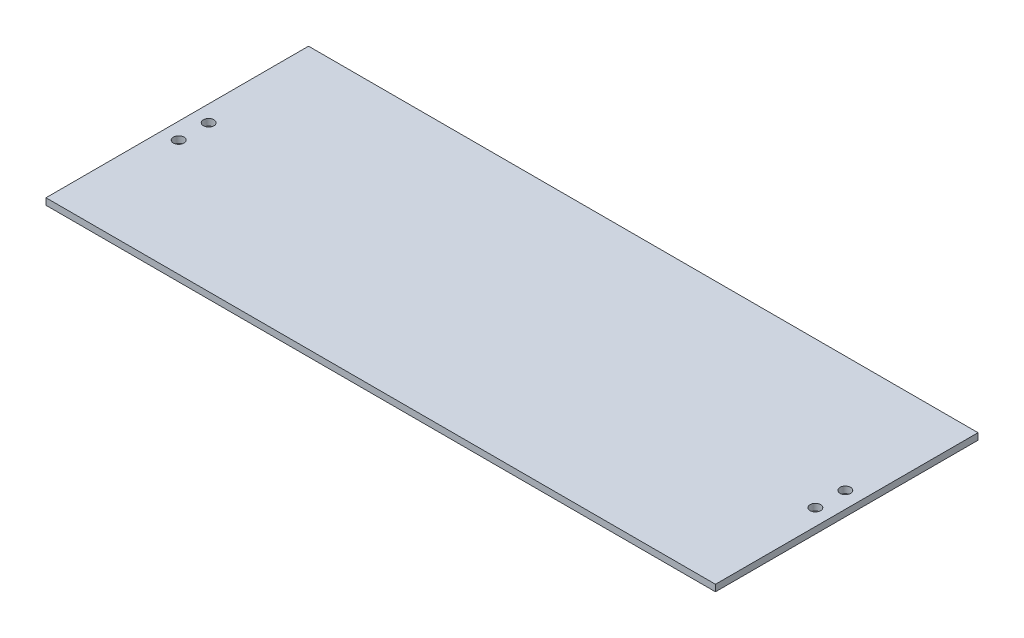
ISO-10303-21;
HEADER;
FILE_DESCRIPTION(('STEP AP214'),'2;1');
FILE_NAME('part.step','',(''),(''),'','','');
FILE_SCHEMA(('AUTOMOTIVE_DESIGN { 1 0 10303 214 1 1 1 1 }'));
ENDSEC;
DATA;
#1=APPLICATION_CONTEXT('core data for automotive mechanical design processes');
#2=APPLICATION_PROTOCOL_DEFINITION('international standard','automotive_design',2000,#1);
#3=PRODUCT_CONTEXT('',#1,'mechanical');
#4=PRODUCT('Part','Part','',(#3));
#5=PRODUCT_RELATED_PRODUCT_CATEGORY('part','',(#4));
#6=PRODUCT_DEFINITION_FORMATION('','',#4);
#7=PRODUCT_DEFINITION_CONTEXT('part definition',#1,'design');
#8=PRODUCT_DEFINITION('design','',#6,#7);
#9=PRODUCT_DEFINITION_SHAPE('','',#8);
#10=(LENGTH_UNIT() NAMED_UNIT(*) SI_UNIT(.MILLI.,.METRE.));
#11=(NAMED_UNIT(*) PLANE_ANGLE_UNIT() SI_UNIT($,.RADIAN.));
#12=(NAMED_UNIT(*) SI_UNIT($,.STERADIAN.) SOLID_ANGLE_UNIT());
#13=UNCERTAINTY_MEASURE_WITH_UNIT(LENGTH_MEASURE(1.E-05),#10,'distance_accuracy_value','');
#14=(GEOMETRIC_REPRESENTATION_CONTEXT(3) GLOBAL_UNCERTAINTY_ASSIGNED_CONTEXT((#13)) GLOBAL_UNIT_ASSIGNED_CONTEXT((#10,
#11,#12)) REPRESENTATION_CONTEXT('',''));
#15=CARTESIAN_POINT('',(0.,0.,0.));
#16=DIRECTION('',(0.,0.,1.));
#17=DIRECTION('',(1.,0.,0.));
#18=AXIS2_PLACEMENT_3D('',#15,#16,#17);
#19=CARTESIAN_POINT('',(0.,3.175,0.));
#20=DIRECTION('',(1.,0.,0.));
#21=DIRECTION('',(0.,0.,-1.));
#22=AXIS2_PLACEMENT_3D('',#19,#20,#21);
#23=PLANE('',#22);
#24=DIRECTION('',(0.,0.,1.));
#25=VECTOR('',#24,1.);
#26=CARTESIAN_POINT('',(0.,0.,0.));
#27=LINE('',#26,#25);
#28=CARTESIAN_POINT('',(0.,0.,-127.));
#29=VERTEX_POINT('',#28);
#30=CARTESIAN_POINT('',(0.,0.,0.));
#31=VERTEX_POINT('',#30);
#32=EDGE_CURVE('E101',#29,#31,#27,.T.);
#33=ORIENTED_EDGE('',*,*,#32,.T.);
#34=DIRECTION('',(0.,-1.,0.));
#35=VECTOR('',#34,1.);
#36=CARTESIAN_POINT('',(0.,3.175,0.));
#37=LINE('',#36,#35);
#38=CARTESIAN_POINT('',(0.,3.175,0.));
#39=VERTEX_POINT('',#38);
#40=EDGE_CURVE('E11',#39,#31,#37,.T.);
#41=ORIENTED_EDGE('',*,*,#40,.F.);
#42=DIRECTION('',(0.,0.,1.));
#43=VECTOR('',#42,1.);
#44=CARTESIAN_POINT('',(0.,3.175,0.));
#45=LINE('',#44,#43);
#46=CARTESIAN_POINT('',(0.,3.175,-127.));
#47=VERTEX_POINT('',#46);
#48=EDGE_CURVE('E88',#47,#39,#45,.T.);
#49=ORIENTED_EDGE('',*,*,#48,.F.);
#50=DIRECTION('',(0.,-1.,0.));
#51=VECTOR('',#50,1.);
#52=CARTESIAN_POINT('',(0.,3.175,-127.));
#53=LINE('',#52,#51);
#54=EDGE_CURVE('E97',#47,#29,#53,.T.);
#55=ORIENTED_EDGE('',*,*,#54,.T.);
#56=EDGE_LOOP('',(#33,#41,#49,#55));
#57=FACE_BOUND('',#56,.T.);
#58=ADVANCED_FACE('F35',(#57),#23,.F.);
#59=CARTESIAN_POINT('',(0.,3.175,0.));
#60=DIRECTION('',(0.,0.,-1.));
#61=DIRECTION('',(-1.,0.,0.));
#62=AXIS2_PLACEMENT_3D('',#59,#60,#61);
#63=PLANE('',#62);
#64=DIRECTION('',(1.,0.,0.));
#65=VECTOR('',#64,1.);
#66=CARTESIAN_POINT('',(0.,0.,0.));
#67=LINE('',#66,#65);
#68=CARTESIAN_POINT('',(323.85,0.,0.));
#69=VERTEX_POINT('',#68);
#70=EDGE_CURVE('E92',#31,#69,#67,.T.);
#71=ORIENTED_EDGE('',*,*,#70,.T.);
#72=DIRECTION('',(0.,-1.,0.));
#73=VECTOR('',#72,1.);
#74=CARTESIAN_POINT('',(323.85,3.175,0.));
#75=LINE('',#74,#73);
#76=CARTESIAN_POINT('',(323.85,3.175,0.));
#77=VERTEX_POINT('',#76);
#78=EDGE_CURVE('E44',#77,#69,#75,.T.);
#79=ORIENTED_EDGE('',*,*,#78,.F.);
#80=DIRECTION('',(1.,0.,0.));
#81=VECTOR('',#80,1.);
#82=CARTESIAN_POINT('',(0.,3.175,0.));
#83=LINE('',#82,#81);
#84=EDGE_CURVE('E83',#39,#77,#83,.T.);
#85=ORIENTED_EDGE('',*,*,#84,.F.);
#86=ORIENTED_EDGE('',*,*,#40,.T.);
#87=EDGE_LOOP('',(#71,#79,#85,#86));
#88=FACE_BOUND('',#87,.T.);
#89=ADVANCED_FACE('F91',(#88),#63,.F.);
#90=CARTESIAN_POINT('',(323.85,3.175,0.));
#91=DIRECTION('',(-1.,0.,0.));
#92=DIRECTION('',(0.,0.,1.));
#93=AXIS2_PLACEMENT_3D('',#90,#91,#92);
#94=PLANE('',#93);
#95=DIRECTION('',(0.,0.,-1.));
#96=VECTOR('',#95,1.);
#97=CARTESIAN_POINT('',(323.85,0.,0.));
#98=LINE('',#97,#96);
#99=CARTESIAN_POINT('',(323.85,0.,-127.));
#100=VERTEX_POINT('',#99);
#101=EDGE_CURVE('E70',#69,#100,#98,.T.);
#102=ORIENTED_EDGE('',*,*,#101,.T.);
#103=DIRECTION('',(0.,-1.,0.));
#104=VECTOR('',#103,1.);
#105=CARTESIAN_POINT('',(323.85,3.175,-127.));
#106=LINE('',#105,#104);
#107=CARTESIAN_POINT('',(323.85,3.175,-127.));
#108=VERTEX_POINT('',#107);
#109=EDGE_CURVE('E93',#108,#100,#106,.T.);
#110=ORIENTED_EDGE('',*,*,#109,.F.);
#111=DIRECTION('',(0.,0.,-1.));
#112=VECTOR('',#111,1.);
#113=CARTESIAN_POINT('',(323.85,3.175,0.));
#114=LINE('',#113,#112);
#115=EDGE_CURVE('E86',#77,#108,#114,.T.);
#116=ORIENTED_EDGE('',*,*,#115,.F.);
#117=ORIENTED_EDGE('',*,*,#78,.T.);
#118=EDGE_LOOP('',(#102,#110,#116,#117));
#119=FACE_BOUND('',#118,.T.);
#120=ADVANCED_FACE('F95',(#119),#94,.F.);
#121=CARTESIAN_POINT('',(0.,3.175,-127.));
#122=DIRECTION('',(0.,0.,1.));
#123=DIRECTION('',(1.,0.,0.));
#124=AXIS2_PLACEMENT_3D('',#121,#122,#123);
#125=PLANE('',#124);
#126=DIRECTION('',(-1.,0.,0.));
#127=VECTOR('',#126,1.);
#128=CARTESIAN_POINT('',(0.,0.,-127.));
#129=LINE('',#128,#127);
#130=EDGE_CURVE('E76',#100,#29,#129,.T.);
#131=ORIENTED_EDGE('',*,*,#130,.T.);
#132=ORIENTED_EDGE('',*,*,#54,.F.);
#133=DIRECTION('',(-1.,0.,0.));
#134=VECTOR('',#133,1.);
#135=CARTESIAN_POINT('',(0.,3.175,-127.));
#136=LINE('',#135,#134);
#137=EDGE_CURVE('E53',#108,#47,#136,.T.);
#138=ORIENTED_EDGE('',*,*,#137,.F.);
#139=ORIENTED_EDGE('',*,*,#109,.T.);
#140=EDGE_LOOP('',(#131,#132,#138,#139));
#141=FACE_BOUND('',#140,.T.);
#142=ADVANCED_FACE('F139',(#141),#125,.F.);
#143=CARTESIAN_POINT('',(0.,3.175,0.));
#144=DIRECTION('',(0.,-1.,0.));
#145=DIRECTION('',(0.,0.,-1.));
#146=AXIS2_PLACEMENT_3D('',#143,#144,#145);
#147=PLANE('',#146);
#148=CARTESIAN_POINT('',(315.9125,3.175,-70.7500000000001));
#149=DIRECTION('',(0.,1.,0.));
#150=DIRECTION('',(0.,0.,1.));
#151=AXIS2_PLACEMENT_3D('',#148,#149,#150);
#152=CIRCLE('',#151,2.55269999999996);
#153=CARTESIAN_POINT('',(315.9125,3.175,-68.1973000000002));
#154=VERTEX_POINT('',#153);
#155=EDGE_CURVE('E218',#154,#154,#152,.T.);
#156=ORIENTED_EDGE('',*,*,#155,.F.);
#157=EDGE_LOOP('',(#156));
#158=FACE_BOUND('',#157,.T.);
#159=CARTESIAN_POINT('',(315.9125,3.175,-56.2500000000001));
#160=DIRECTION('',(0.,1.,0.));
#161=DIRECTION('',(0.,0.,1.));
#162=AXIS2_PLACEMENT_3D('',#159,#160,#161);
#163=CIRCLE('',#162,2.55269999999996);
#164=CARTESIAN_POINT('',(315.9125,3.175,-53.6973000000002));
#165=VERTEX_POINT('',#164);
#166=EDGE_CURVE('E122',#165,#165,#163,.T.);
#167=ORIENTED_EDGE('',*,*,#166,.F.);
#168=EDGE_LOOP('',(#167));
#169=FACE_BOUND('',#168,.T.);
#170=CARTESIAN_POINT('',(7.93749999999982,3.175,-70.7500000000001));
#171=DIRECTION('',(0.,1.,0.));
#172=DIRECTION('',(0.,0.,1.));
#173=AXIS2_PLACEMENT_3D('',#170,#171,#172);
#174=CIRCLE('',#173,2.55269999999999);
#175=CARTESIAN_POINT('',(7.93749999999982,3.175,-68.1973000000001));
#176=VERTEX_POINT('',#175);
#177=EDGE_CURVE('E112',#176,#176,#174,.T.);
#178=ORIENTED_EDGE('',*,*,#177,.F.);
#179=EDGE_LOOP('',(#178));
#180=FACE_BOUND('',#179,.T.);
#181=CARTESIAN_POINT('',(7.93749999999982,3.175,-56.2500000000001));
#182=DIRECTION('',(0.,1.,0.));
#183=DIRECTION('',(0.,0.,1.));
#184=AXIS2_PLACEMENT_3D('',#181,#182,#183);
#185=CIRCLE('',#184,2.55269999999999);
#186=CARTESIAN_POINT('',(7.93749999999982,3.175,-53.6973000000001));
#187=VERTEX_POINT('',#186);
#188=EDGE_CURVE('E111',#187,#187,#185,.T.);
#189=ORIENTED_EDGE('',*,*,#188,.F.);
#190=EDGE_LOOP('',(#189));
#191=FACE_BOUND('',#190,.T.);
#192=ORIENTED_EDGE('',*,*,#48,.T.);
#193=ORIENTED_EDGE('',*,*,#84,.T.);
#194=ORIENTED_EDGE('',*,*,#115,.T.);
#195=ORIENTED_EDGE('',*,*,#137,.T.);
#196=EDGE_LOOP('',(#192,#193,#194,#195));
#197=FACE_BOUND('',#196,.T.);
#198=ADVANCED_FACE('F84',(#158,#169,#180,#191,#197),#147,.F.);
#199=CARTESIAN_POINT('',(0.,0.,0.));
#200=DIRECTION('',(0.,-1.,0.));
#201=DIRECTION('',(0.,0.,-1.));
#202=AXIS2_PLACEMENT_3D('',#199,#200,#201);
#203=PLANE('',#202);
#204=CARTESIAN_POINT('',(315.9125,0.,-70.7500000000001));
#205=DIRECTION('',(0.,-1.,0.));
#206=DIRECTION('',(0.,0.,-1.));
#207=AXIS2_PLACEMENT_3D('',#204,#205,#206);
#208=CIRCLE('',#207,2.55269999999996);
#209=CARTESIAN_POINT('',(315.9125,0.,-73.3027000000001));
#210=VERTEX_POINT('',#209);
#211=EDGE_CURVE('E215',#210,#210,#208,.T.);
#212=ORIENTED_EDGE('',*,*,#211,.F.);
#213=EDGE_LOOP('',(#212));
#214=FACE_BOUND('',#213,.T.);
#215=CARTESIAN_POINT('',(315.9125,0.,-56.2500000000001));
#216=DIRECTION('',(0.,-1.,0.));
#217=DIRECTION('',(0.,0.,-1.));
#218=AXIS2_PLACEMENT_3D('',#215,#216,#217);
#219=CIRCLE('',#218,2.55269999999996);
#220=CARTESIAN_POINT('',(315.9125,0.,-58.8027000000001));
#221=VERTEX_POINT('',#220);
#222=EDGE_CURVE('E38',#221,#221,#219,.T.);
#223=ORIENTED_EDGE('',*,*,#222,.F.);
#224=EDGE_LOOP('',(#223));
#225=FACE_BOUND('',#224,.T.);
#226=CARTESIAN_POINT('',(7.93749999999982,0.,-70.7500000000001));
#227=DIRECTION('',(0.,-1.,0.));
#228=DIRECTION('',(0.,0.,-1.));
#229=AXIS2_PLACEMENT_3D('',#226,#227,#228);
#230=CIRCLE('',#229,2.55269999999999);
#231=CARTESIAN_POINT('',(7.93749999999982,0.,-73.3027000000001));
#232=VERTEX_POINT('',#231);
#233=EDGE_CURVE('E109',#232,#232,#230,.T.);
#234=ORIENTED_EDGE('',*,*,#233,.F.);
#235=EDGE_LOOP('',(#234));
#236=FACE_BOUND('',#235,.T.);
#237=CARTESIAN_POINT('',(7.93749999999982,0.,-56.2500000000001));
#238=DIRECTION('',(0.,-1.,0.));
#239=DIRECTION('',(0.,0.,-1.));
#240=AXIS2_PLACEMENT_3D('',#237,#238,#239);
#241=CIRCLE('',#240,2.55269999999999);
#242=CARTESIAN_POINT('',(7.93749999999982,0.,-58.8027000000001));
#243=VERTEX_POINT('',#242);
#244=EDGE_CURVE('E104',#243,#243,#241,.T.);
#245=ORIENTED_EDGE('',*,*,#244,.F.);
#246=EDGE_LOOP('',(#245));
#247=FACE_BOUND('',#246,.T.);
#248=ORIENTED_EDGE('',*,*,#32,.F.);
#249=ORIENTED_EDGE('',*,*,#130,.F.);
#250=ORIENTED_EDGE('',*,*,#101,.F.);
#251=ORIENTED_EDGE('',*,*,#70,.F.);
#252=EDGE_LOOP('',(#248,#249,#250,#251));
#253=FACE_BOUND('',#252,.T.);
#254=ADVANCED_FACE('F132',(#214,#225,#236,#247,#253),#203,.T.);
#255=CARTESIAN_POINT('',(7.93749999999982,3.175,-56.2500000000001));
#256=DIRECTION('',(0.,1.,0.));
#257=DIRECTION('',(0.,0.,1.));
#258=AXIS2_PLACEMENT_3D('',#255,#256,#257);
#259=CYLINDRICAL_SURFACE('',#258,2.55269999999999);
#260=ORIENTED_EDGE('',*,*,#244,.T.);
#261=EDGE_LOOP('',(#260));
#262=FACE_BOUND('',#261,.T.);
#263=ORIENTED_EDGE('',*,*,#188,.T.);
#264=EDGE_LOOP('',(#263));
#265=FACE_BOUND('',#264,.T.);
#266=ADVANCED_FACE('F129',(#262,#265),#259,.F.);
#267=CARTESIAN_POINT('',(7.93749999999982,3.175,-70.7500000000001));
#268=DIRECTION('',(0.,1.,0.));
#269=DIRECTION('',(0.,0.,1.));
#270=AXIS2_PLACEMENT_3D('',#267,#268,#269);
#271=CYLINDRICAL_SURFACE('',#270,2.55269999999999);
#272=ORIENTED_EDGE('',*,*,#233,.T.);
#273=EDGE_LOOP('',(#272));
#274=FACE_BOUND('',#273,.T.);
#275=ORIENTED_EDGE('',*,*,#177,.T.);
#276=EDGE_LOOP('',(#275));
#277=FACE_BOUND('',#276,.T.);
#278=ADVANCED_FACE('F180',(#274,#277),#271,.F.);
#279=CARTESIAN_POINT('',(315.9125,3.175,-56.2500000000001));
#280=DIRECTION('',(0.,1.,0.));
#281=DIRECTION('',(0.,0.,1.));
#282=AXIS2_PLACEMENT_3D('',#279,#280,#281);
#283=CYLINDRICAL_SURFACE('',#282,2.55269999999996);
#284=ORIENTED_EDGE('',*,*,#222,.T.);
#285=EDGE_LOOP('',(#284));
#286=FACE_BOUND('',#285,.T.);
#287=ORIENTED_EDGE('',*,*,#166,.T.);
#288=EDGE_LOOP('',(#287));
#289=FACE_BOUND('',#288,.T.);
#290=ADVANCED_FACE('F189',(#286,#289),#283,.F.);
#291=CARTESIAN_POINT('',(315.9125,3.175,-70.7500000000001));
#292=DIRECTION('',(0.,1.,0.));
#293=DIRECTION('',(0.,0.,1.));
#294=AXIS2_PLACEMENT_3D('',#291,#292,#293);
#295=CYLINDRICAL_SURFACE('',#294,2.55269999999996);
#296=ORIENTED_EDGE('',*,*,#211,.T.);
#297=EDGE_LOOP('',(#296));
#298=FACE_BOUND('',#297,.T.);
#299=ORIENTED_EDGE('',*,*,#155,.T.);
#300=EDGE_LOOP('',(#299));
#301=FACE_BOUND('',#300,.T.);
#302=ADVANCED_FACE('F198',(#298,#301),#295,.F.);
#303=CLOSED_SHELL('',(#58,#89,#120,#142,#198,#254,#266,#278,#290,#302));
#304=MANIFOLD_SOLID_BREP('B2',#303);
#305=ADVANCED_BREP_SHAPE_REPRESENTATION('',(#18,#304),#14);
#306=SHAPE_DEFINITION_REPRESENTATION(#9,#305);
ENDSEC;
END-ISO-10303-21;
